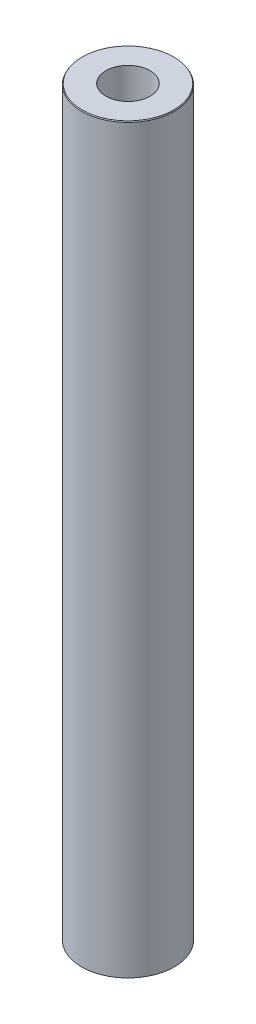
ISO-10303-21;
HEADER;
FILE_DESCRIPTION(('STEP AP214'),'2;1');
FILE_NAME('part.step','',(''),(''),'','','');
FILE_SCHEMA(('AUTOMOTIVE_DESIGN { 1 0 10303 214 1 1 1 1 }'));
ENDSEC;
DATA;
#1=APPLICATION_CONTEXT('core data for automotive mechanical design processes');
#2=APPLICATION_PROTOCOL_DEFINITION('international standard','automotive_design',2000,#1);
#3=PRODUCT_CONTEXT('',#1,'mechanical');
#4=PRODUCT('Part','Part','',(#3));
#5=PRODUCT_RELATED_PRODUCT_CATEGORY('part','',(#4));
#6=PRODUCT_DEFINITION_FORMATION('','',#4);
#7=PRODUCT_DEFINITION_CONTEXT('part definition',#1,'design');
#8=PRODUCT_DEFINITION('design','',#6,#7);
#9=PRODUCT_DEFINITION_SHAPE('','',#8);
#10=(LENGTH_UNIT() NAMED_UNIT(*) SI_UNIT(.MILLI.,.METRE.));
#11=(NAMED_UNIT(*) PLANE_ANGLE_UNIT() SI_UNIT($,.RADIAN.));
#12=(NAMED_UNIT(*) SI_UNIT($,.STERADIAN.) SOLID_ANGLE_UNIT());
#13=UNCERTAINTY_MEASURE_WITH_UNIT(LENGTH_MEASURE(1.E-05),#10,'distance_accuracy_value','');
#14=(GEOMETRIC_REPRESENTATION_CONTEXT(3) GLOBAL_UNCERTAINTY_ASSIGNED_CONTEXT((#13)) GLOBAL_UNIT_ASSIGNED_CONTEXT((#10,
#11,#12)) REPRESENTATION_CONTEXT('',''));
#15=CARTESIAN_POINT('',(0.,0.,0.));
#16=DIRECTION('',(0.,0.,1.));
#17=DIRECTION('',(1.,0.,0.));
#18=AXIS2_PLACEMENT_3D('',#15,#16,#17);
#19=CARTESIAN_POINT('',(0.,600.,0.));
#20=DIRECTION('',(0.,-1.,0.));
#21=DIRECTION('',(0.,0.,-1.));
#22=AXIS2_PLACEMENT_3D('',#19,#20,#21);
#23=CYLINDRICAL_SURFACE('',#22,37.5);
#24=CARTESIAN_POINT('',(0.,599.205976423147,0.));
#25=DIRECTION('',(0.,1.,0.));
#26=DIRECTION('',(0.,0.,1.));
#27=AXIS2_PLACEMENT_3D('',#24,#25,#26);
#28=CIRCLE('',#27,37.5);
#29=CARTESIAN_POINT('',(0.,599.205976423147,37.5));
#30=VERTEX_POINT('',#29);
#31=EDGE_CURVE('E50',#30,#30,#28,.F.);
#32=ORIENTED_EDGE('',*,*,#31,.T.);
#33=EDGE_LOOP('',(#32));
#34=FACE_BOUND('',#33,.T.);
#35=CARTESIAN_POINT('',(0.,0.458429725839204,0.));
#36=DIRECTION('',(0.,1.,0.));
#37=DIRECTION('',(0.,0.,1.));
#38=AXIS2_PLACEMENT_3D('',#35,#36,#37);
#39=CIRCLE('',#38,37.5);
#40=CARTESIAN_POINT('',(0.,0.458429725839204,37.5));
#41=VERTEX_POINT('',#40);
#42=EDGE_CURVE('E51',#41,#41,#39,.T.);
#43=ORIENTED_EDGE('',*,*,#42,.T.);
#44=EDGE_LOOP('',(#43));
#45=FACE_BOUND('',#44,.T.);
#46=ADVANCED_FACE('F39',(#34,#45),#23,.T.);
#47=CARTESIAN_POINT('',(0.,600.,0.));
#48=DIRECTION('',(0.,1.,0.));
#49=DIRECTION('',(0.,0.,1.));
#50=AXIS2_PLACEMENT_3D('',#47,#48,#49);
#51=PLANE('',#50);
#52=CARTESIAN_POINT('',(0.,600.,0.));
#53=DIRECTION('',(0.,1.,0.));
#54=DIRECTION('',(0.,0.,1.));
#55=AXIS2_PLACEMENT_3D('',#52,#53,#54);
#56=CIRCLE('',#55,37.0415702741608);
#57=CARTESIAN_POINT('',(0.,600.,37.0415702741608));
#58=VERTEX_POINT('',#57);
#59=EDGE_CURVE('E54',#58,#58,#56,.T.);
#60=ORIENTED_EDGE('',*,*,#59,.T.);
#61=EDGE_LOOP('',(#60));
#62=FACE_BOUND('',#61,.T.);
#63=CARTESIAN_POINT('',(0.,600.,0.));
#64=DIRECTION('',(0.,1.,0.));
#65=DIRECTION('',(0.,0.,1.));
#66=AXIS2_PLACEMENT_3D('',#63,#64,#65);
#67=CIRCLE('',#66,17.898668844367);
#68=CARTESIAN_POINT('',(0.,600.,17.898668844367));
#69=VERTEX_POINT('',#68);
#70=EDGE_CURVE('E58',#69,#69,#67,.T.);
#71=ORIENTED_EDGE('',*,*,#70,.F.);
#72=EDGE_LOOP('',(#71));
#73=FACE_BOUND('',#72,.T.);
#74=ADVANCED_FACE('F69',(#62,#73),#51,.T.);
#75=CARTESIAN_POINT('',(0.,0.,0.));
#76=DIRECTION('',(0.,1.,0.));
#77=DIRECTION('',(0.,0.,1.));
#78=AXIS2_PLACEMENT_3D('',#75,#76,#77);
#79=PLANE('',#78);
#80=CARTESIAN_POINT('',(0.,0.,0.));
#81=DIRECTION('',(0.,1.,0.));
#82=DIRECTION('',(0.,0.,1.));
#83=AXIS2_PLACEMENT_3D('',#80,#81,#82);
#84=CIRCLE('',#83,36.7059764231467);
#85=CARTESIAN_POINT('',(0.,0.,36.7059764231467));
#86=VERTEX_POINT('',#85);
#87=EDGE_CURVE('E10',#86,#86,#84,.F.);
#88=ORIENTED_EDGE('',*,*,#87,.T.);
#89=EDGE_LOOP('',(#88));
#90=FACE_BOUND('',#89,.T.);
#91=CARTESIAN_POINT('',(0.,0.,0.));
#92=DIRECTION('',(0.,1.,0.));
#93=DIRECTION('',(0.,0.,1.));
#94=AXIS2_PLACEMENT_3D('',#91,#92,#93);
#95=CIRCLE('',#94,17.898668844367);
#96=CARTESIAN_POINT('',(0.,0.,17.898668844367));
#97=VERTEX_POINT('',#96);
#98=EDGE_CURVE('E63',#97,#97,#95,.T.);
#99=ORIENTED_EDGE('',*,*,#98,.T.);
#100=EDGE_LOOP('',(#99));
#101=FACE_BOUND('',#100,.T.);
#102=ADVANCED_FACE('F75',(#90,#101),#79,.F.);
#103=CARTESIAN_POINT('',(0.,600.,0.));
#104=DIRECTION('',(0.,-1.,0.));
#105=DIRECTION('',(0.,0.,-1.));
#106=AXIS2_PLACEMENT_3D('',#103,#104,#105);
#107=CYLINDRICAL_SURFACE('',#106,17.898668844367);
#108=ORIENTED_EDGE('',*,*,#70,.T.);
#109=EDGE_LOOP('',(#108));
#110=FACE_BOUND('',#109,.T.);
#111=ORIENTED_EDGE('',*,*,#98,.F.);
#112=EDGE_LOOP('',(#111));
#113=FACE_BOUND('',#112,.T.);
#114=ADVANCED_FACE('F70',(#110,#113),#107,.F.);
#115=CARTESIAN_POINT('',(0.,600.,0.));
#116=DIRECTION('',(0.,-1.,0.));
#117=DIRECTION('',(0.,0.,-1.));
#118=AXIS2_PLACEMENT_3D('',#115,#116,#117);
#119=CONICAL_SURFACE('',#118,37.0415702741608,0.523598775598294);
#120=ORIENTED_EDGE('',*,*,#31,.F.);
#121=EDGE_LOOP('',(#120));
#122=FACE_BOUND('',#121,.T.);
#123=ORIENTED_EDGE('',*,*,#59,.F.);
#124=EDGE_LOOP('',(#123));
#125=FACE_BOUND('',#124,.T.);
#126=ADVANCED_FACE('F81',(#122,#125),#119,.T.);
#127=CARTESIAN_POINT('',(0.,0.458429725839204,0.));
#128=DIRECTION('',(0.,1.,0.));
#129=DIRECTION('',(0.,0.,1.));
#130=AXIS2_PLACEMENT_3D('',#127,#128,#129);
#131=CONICAL_SURFACE('',#130,37.5,1.04719755119655);
#132=ORIENTED_EDGE('',*,*,#87,.F.);
#133=EDGE_LOOP('',(#132));
#134=FACE_BOUND('',#133,.T.);
#135=ORIENTED_EDGE('',*,*,#42,.F.);
#136=EDGE_LOOP('',(#135));
#137=FACE_BOUND('',#136,.T.);
#138=ADVANCED_FACE('F45',(#134,#137),#131,.T.);
#139=CLOSED_SHELL('',(#46,#74,#102,#114,#126,#138));
#140=MANIFOLD_SOLID_BREP('B2',#139);
#141=ADVANCED_BREP_SHAPE_REPRESENTATION('',(#18,#140),#14);
#142=SHAPE_DEFINITION_REPRESENTATION(#9,#141);
ENDSEC;
END-ISO-10303-21;
